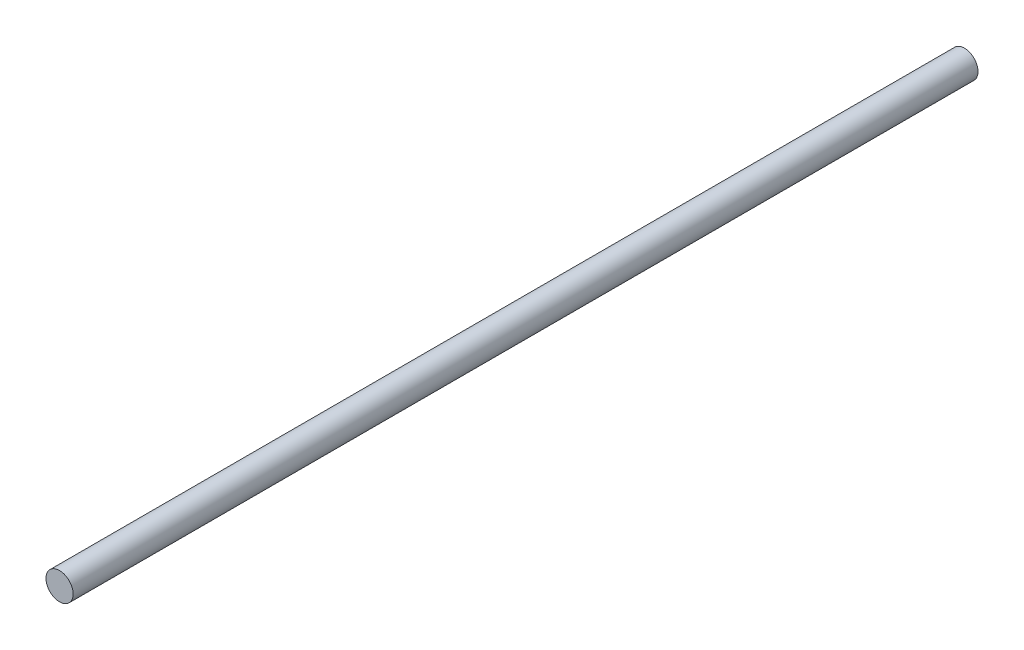
ISO-10303-21;
HEADER;
FILE_DESCRIPTION(('STEP AP214'),'2;1');
FILE_NAME('part.step','',(''),(''),'','','');
FILE_SCHEMA(('AUTOMOTIVE_DESIGN { 1 0 10303 214 1 1 1 1 }'));
ENDSEC;
DATA;
#1=APPLICATION_CONTEXT('core data for automotive mechanical design processes');
#2=APPLICATION_PROTOCOL_DEFINITION('international standard','automotive_design',2000,#1);
#3=PRODUCT_CONTEXT('',#1,'mechanical');
#4=PRODUCT('Part','Part','',(#3));
#5=PRODUCT_RELATED_PRODUCT_CATEGORY('part','',(#4));
#6=PRODUCT_DEFINITION_FORMATION('','',#4);
#7=PRODUCT_DEFINITION_CONTEXT('part definition',#1,'design');
#8=PRODUCT_DEFINITION('design','',#6,#7);
#9=PRODUCT_DEFINITION_SHAPE('','',#8);
#10=(LENGTH_UNIT() NAMED_UNIT(*) SI_UNIT(.MILLI.,.METRE.));
#11=(NAMED_UNIT(*) PLANE_ANGLE_UNIT() SI_UNIT($,.RADIAN.));
#12=(NAMED_UNIT(*) SI_UNIT($,.STERADIAN.) SOLID_ANGLE_UNIT());
#13=UNCERTAINTY_MEASURE_WITH_UNIT(LENGTH_MEASURE(1.E-05),#10,'distance_accuracy_value','');
#14=(GEOMETRIC_REPRESENTATION_CONTEXT(3) GLOBAL_UNCERTAINTY_ASSIGNED_CONTEXT((#13)) GLOBAL_UNIT_ASSIGNED_CONTEXT((#10,
#11,#12)) REPRESENTATION_CONTEXT('',''));
#15=CARTESIAN_POINT('',(0.,0.,0.));
#16=DIRECTION('',(0.,0.,1.));
#17=DIRECTION('',(1.,0.,0.));
#18=AXIS2_PLACEMENT_3D('',#15,#16,#17);
#19=CARTESIAN_POINT('',(0.,0.,200.));
#20=DIRECTION('',(0.,0.,-1.));
#21=DIRECTION('',(-1.,0.,0.));
#22=AXIS2_PLACEMENT_3D('',#19,#20,#21);
#23=CYLINDRICAL_SURFACE('',#22,3.);
#24=CARTESIAN_POINT('',(0.,0.,200.));
#25=DIRECTION('',(0.,0.,1.));
#26=DIRECTION('',(1.,0.,0.));
#27=AXIS2_PLACEMENT_3D('',#24,#25,#26);
#28=CIRCLE('',#27,3.);
#29=CARTESIAN_POINT('',(3.,0.,200.));
#30=VERTEX_POINT('',#29);
#31=EDGE_CURVE('E10',#30,#30,#28,.T.);
#32=ORIENTED_EDGE('',*,*,#31,.F.);
#33=EDGE_LOOP('',(#32));
#34=FACE_BOUND('',#33,.T.);
#35=CARTESIAN_POINT('',(0.,0.,0.));
#36=DIRECTION('',(0.,0.,1.));
#37=DIRECTION('',(1.,0.,0.));
#38=AXIS2_PLACEMENT_3D('',#35,#36,#37);
#39=CIRCLE('',#38,3.);
#40=CARTESIAN_POINT('',(3.,0.,0.));
#41=VERTEX_POINT('',#40);
#42=EDGE_CURVE('E34',#41,#41,#39,.T.);
#43=ORIENTED_EDGE('',*,*,#42,.T.);
#44=EDGE_LOOP('',(#43));
#45=FACE_BOUND('',#44,.T.);
#46=ADVANCED_FACE('F31',(#34,#45),#23,.T.);
#47=CARTESIAN_POINT('',(0.,0.,200.));
#48=DIRECTION('',(0.,0.,1.));
#49=DIRECTION('',(1.,0.,0.));
#50=AXIS2_PLACEMENT_3D('',#47,#48,#49);
#51=PLANE('',#50);
#52=ORIENTED_EDGE('',*,*,#31,.T.);
#53=EDGE_LOOP('',(#52));
#54=FACE_BOUND('',#53,.T.);
#55=ADVANCED_FACE('F46',(#54),#51,.T.);
#56=CARTESIAN_POINT('',(0.,0.,0.));
#57=DIRECTION('',(0.,0.,1.));
#58=DIRECTION('',(1.,0.,0.));
#59=AXIS2_PLACEMENT_3D('',#56,#57,#58);
#60=PLANE('',#59);
#61=ORIENTED_EDGE('',*,*,#42,.F.);
#62=EDGE_LOOP('',(#61));
#63=FACE_BOUND('',#62,.T.);
#64=ADVANCED_FACE('F44',(#63),#60,.F.);
#65=CLOSED_SHELL('',(#46,#55,#64));
#66=MANIFOLD_SOLID_BREP('B2',#65);
#67=ADVANCED_BREP_SHAPE_REPRESENTATION('',(#18,#66),#14);
#68=SHAPE_DEFINITION_REPRESENTATION(#9,#67);
ENDSEC;
END-ISO-10303-21;
